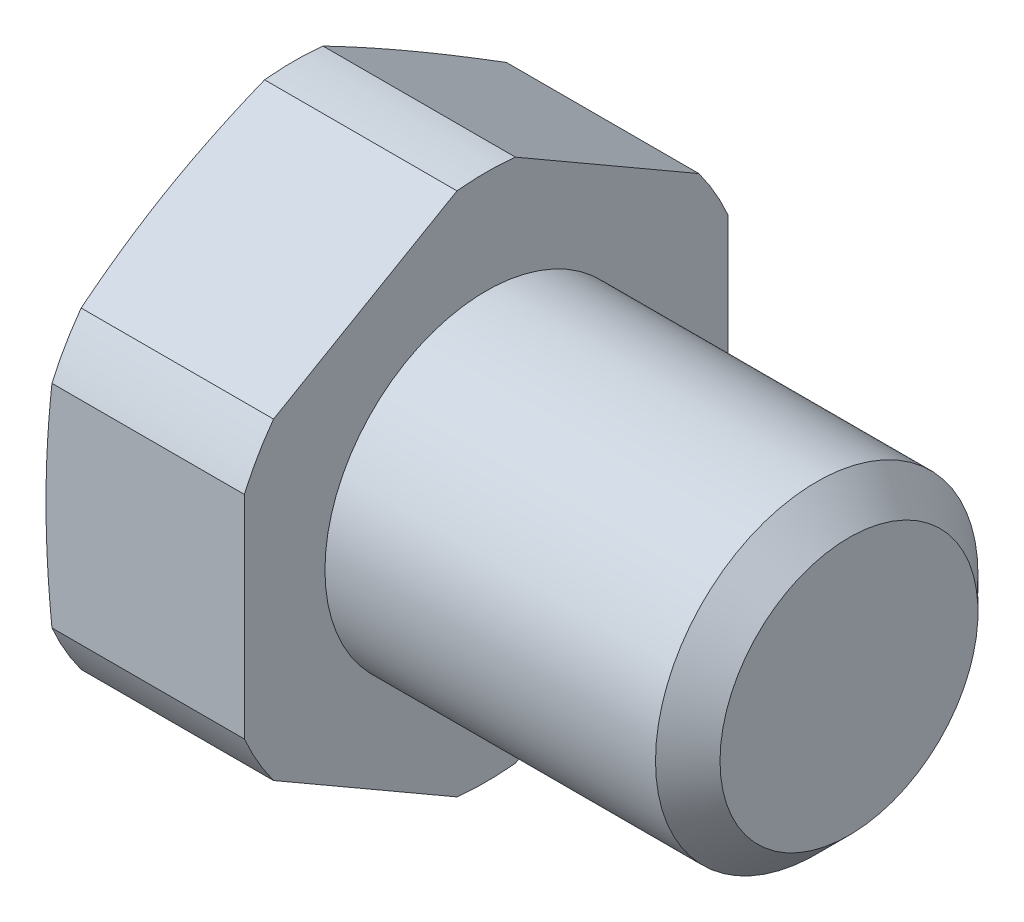
ISO-10303-21;
HEADER;
FILE_DESCRIPTION(('STEP AP214'),'2;1');
FILE_NAME('part.step','',(''),(''),'','','');
FILE_SCHEMA(('AUTOMOTIVE_DESIGN { 1 0 10303 214 1 1 1 1 }'));
ENDSEC;
DATA;
#1=APPLICATION_CONTEXT('core data for automotive mechanical design processes');
#2=APPLICATION_PROTOCOL_DEFINITION('international standard','automotive_design',2000,#1);
#3=PRODUCT_CONTEXT('',#1,'mechanical');
#4=PRODUCT('Part','Part','',(#3));
#5=PRODUCT_RELATED_PRODUCT_CATEGORY('part','',(#4));
#6=PRODUCT_DEFINITION_FORMATION('','',#4);
#7=PRODUCT_DEFINITION_CONTEXT('part definition',#1,'design');
#8=PRODUCT_DEFINITION('design','',#6,#7);
#9=PRODUCT_DEFINITION_SHAPE('','',#8);
#10=(LENGTH_UNIT() NAMED_UNIT(*) SI_UNIT(.MILLI.,.METRE.));
#11=(NAMED_UNIT(*) PLANE_ANGLE_UNIT() SI_UNIT($,.RADIAN.));
#12=(NAMED_UNIT(*) SI_UNIT($,.STERADIAN.) SOLID_ANGLE_UNIT());
#13=UNCERTAINTY_MEASURE_WITH_UNIT(LENGTH_MEASURE(1.E-05),#10,'distance_accuracy_value','');
#14=(GEOMETRIC_REPRESENTATION_CONTEXT(3) GLOBAL_UNCERTAINTY_ASSIGNED_CONTEXT((#13)) GLOBAL_UNIT_ASSIGNED_CONTEXT((#10,
#11,#12)) REPRESENTATION_CONTEXT('',''));
#15=CARTESIAN_POINT('',(0.,0.,0.));
#16=DIRECTION('',(0.,0.,1.));
#17=DIRECTION('',(1.,0.,0.));
#18=AXIS2_PLACEMENT_3D('',#15,#16,#17);
#19=CARTESIAN_POINT('',(-9.54448637286709,0.,0.));
#20=DIRECTION('',(1.,0.,0.));
#21=DIRECTION('',(0.,0.,-1.));
#22=AXIS2_PLACEMENT_3D('',#19,#20,#21);
#23=CONICAL_SURFACE('',#22,13.1,1.30899693899574);
#24=CARTESIAN_POINT('',(-10.,0.,0.));
#25=DIRECTION('',(-1.,0.,0.));
#26=DIRECTION('',(0.,0.,1.));
#27=AXIS2_PLACEMENT_3D('',#24,#25,#26);
#28=CIRCLE('',#27,11.4);
#29=CARTESIAN_POINT('',(-10.,0.,11.4));
#30=VERTEX_POINT('',#29);
#31=EDGE_CURVE('E136',#30,#30,#28,.T.);
#32=ORIENTED_EDGE('',*,*,#31,.F.);
#33=EDGE_LOOP('',(#32));
#34=FACE_BOUND('',#33,.T.);
#35=CARTESIAN_POINT('',(-9.54428637286709,7.76411361838279,-10.5521607372236));
#36=CARTESIAN_POINT('',(-9.59130577877762,7.98263521863659,-10.1736702230327));
#37=CARTESIAN_POINT('',(-9.63340710310515,8.20143630321216,-9.79469562779668));
#38=CARTESIAN_POINT('',(-9.70668581489536,8.63952643867748,-9.03590125487601));
#39=CARTESIAN_POINT('',(-9.73786154747224,8.85881555843141,-8.65608135791514));
#40=CARTESIAN_POINT('',(-9.78810717889402,9.29705355365927,-7.89703088437335));
#41=CARTESIAN_POINT('',(-9.80721488344556,9.51600132660838,-7.51780221742144));
#42=CARTESIAN_POINT('',(-9.83277608530208,9.95406769036877,-6.7590490183015));
#43=CARTESIAN_POINT('',(-9.83923048454133,10.1731862678911,-6.37952450915063));
#44=CARTESIAN_POINT('',(-9.83923048454133,10.6114234229357,-5.6204754908489));
#45=CARTESIAN_POINT('',(-9.83277608530207,10.830542000458,-5.24095098169803));
#46=CARTESIAN_POINT('',(-9.80721488344554,11.2686083642184,-4.48219778257809));
#47=CARTESIAN_POINT('',(-9.78810717889399,11.4875561371675,-4.10296911562618));
#48=CARTESIAN_POINT('',(-9.7378615474722,11.9257941323954,-3.34391864208439));
#49=CARTESIAN_POINT('',(-9.70668581489532,12.1450832521493,-2.96409874512353));
#50=CARTESIAN_POINT('',(-9.6334071031051,12.5831733876146,-2.20530437220285));
#51=CARTESIAN_POINT('',(-9.59130577877757,12.8019744721902,-1.82632977696681));
#52=CARTESIAN_POINT('',(-9.54428637286703,13.020496072444,-1.44783926277596));
#53=B_SPLINE_CURVE_WITH_KNOTS('',3,(#35,#36,#37,#38,#39,#40,#41,#42,#43,#44,#45,#46,#47,#48,#49,
#50,#51,#52),.UNSPECIFIED.,.F.,.F.,(4,2,2,2,2,2,2,2,4),(0.,1.31871238117365,2.63762441982744,
3.95238391533562,5.26704969068584,6.58171546603607,7.89647496154425,9.21538700019804,
10.5340993813717),.UNSPECIFIED.);
#54=CARTESIAN_POINT('',(-9.54448637286709,7.76504391432934,-10.5505494173781));
#55=VERTEX_POINT('',#54);
#56=CARTESIAN_POINT('',(-9.54448637286709,13.0195657764972,-1.44945058262192));
#57=VERTEX_POINT('',#56);
#58=EDGE_CURVE('E208',#55,#57,#53,.T.);
#59=ORIENTED_EDGE('',*,*,#58,.F.);
#60=CARTESIAN_POINT('',(-9.54448637286709,0.,0.));
#61=DIRECTION('',(-1.,0.,0.));
#62=DIRECTION('',(0.,0.,1.));
#63=AXIS2_PLACEMENT_3D('',#60,#61,#62);
#64=CIRCLE('',#63,13.1);
#65=CARTESIAN_POINT('',(-9.54448637286709,5.25452186216786,-12.));
#66=VERTEX_POINT('',#65);
#67=EDGE_CURVE('E291',#55,#66,#64,.T.);
#68=ORIENTED_EDGE('',*,*,#67,.T.);
#69=CARTESIAN_POINT('',(-7.19295796289398,-18.2909924344328,-12.));
#70=CARTESIAN_POINT('',(-7.3148003749587,-17.7469982484752,-12.));
#71=CARTESIAN_POINT('',(-7.43514648726094,-17.2026627913598,-12.));
#72=CARTESIAN_POINT('',(-7.67203849363134,-16.1131418101345,-12.));
#73=CARTESIAN_POINT('',(-7.7885842224288,-15.5679562501326,-12.));
#74=CARTESIAN_POINT('',(-8.01717027181336,-14.4760742685194,-12.));
#75=CARTESIAN_POINT('',(-8.12920601536953,-13.9293768852682,-12.));
#76=CARTESIAN_POINT('',(-8.34755693589704,-12.8348415359167,-12.));
#77=CARTESIAN_POINT('',(-8.45387216154037,-12.2870035795619,-12.));
#78=CARTESIAN_POINT('',(-8.65859640970622,-11.1943845169536,-12.));
#79=CARTESIAN_POINT('',(-8.7570619074514,-10.6496140449328,-12.));
#80=CARTESIAN_POINT('',(-8.94535866095745,-9.55857103473259,-12.));
#81=CARTESIAN_POINT('',(-9.03518988451791,-9.0122984909591,-12.));
#82=CARTESIAN_POINT('',(-9.20418374695558,-7.91817057841163,-12.));
#83=CARTESIAN_POINT('',(-9.28334789707893,-7.37031544510661,-12.));
#84=CARTESIAN_POINT('',(-9.42866949403048,-6.27286304206024,-12.));
#85=CARTESIAN_POINT('',(-9.494826930215,-5.72326577089364,-12.));
#86=CARTESIAN_POINT('',(-9.6122540230037,-4.61614250812887,-12.));
#87=CARTESIAN_POINT('',(-9.66334597348407,-4.05859738363546,-12.));
#88=CARTESIAN_POINT('',(-9.74711247173178,-2.94211342560942,-12.));
#89=CARTESIAN_POINT('',(-9.77978744184921,-2.38317462433277,-12.));
#90=CARTESIAN_POINT('',(-9.8248138629955,-1.26471341790144,-12.));
#91=CARTESIAN_POINT('',(-9.83717442597382,-0.70519138710796,-12.));
#92=CARTESIAN_POINT('',(-9.84081297334199,0.413922315015158,-12.));
#93=CARTESIAN_POINT('',(-9.83209096922124,0.97351398630668,-12.));
#94=CARTESIAN_POINT('',(-9.79405475762315,2.09402511795535,-12.));
#95=CARTESIAN_POINT('',(-9.76466559878528,2.65494198219382,-12.));
#96=CARTESIAN_POINT('',(-9.68696882411081,3.77545173452887,-12.));
#97=CARTESIAN_POINT('',(-9.63866079210955,4.33504459322843,-12.));
#98=CARTESIAN_POINT('',(-9.52555731405639,5.45290299353698,-12.));
#99=CARTESIAN_POINT('',(-9.46075117916776,6.01116743690909,-12.));
#100=CARTESIAN_POINT('',(-9.31733699991317,7.12590105610526,-12.));
#101=CARTESIAN_POINT('',(-9.23872891329198,7.6823702264277,-12.));
#102=CARTESIAN_POINT('',(-9.07584450117349,8.75644720293307,-12.));
#103=CARTESIAN_POINT('',(-8.99229805095426,9.27416682028566,-12.));
#104=CARTESIAN_POINT('',(-8.81712984665603,10.3082447927288,-12.));
#105=CARTESIAN_POINT('',(-8.72550787395778,10.8246031105765,-12.));
#106=CARTESIAN_POINT('',(-8.53566089294487,11.8561517991209,-12.));
#107=CARTESIAN_POINT('',(-8.43743522550391,12.3713420479096,-12.));
#108=CARTESIAN_POINT('',(-8.23559613103001,13.4006574238735,-12.));
#109=CARTESIAN_POINT('',(-8.13198275236719,13.9147825605681,-12.));
#110=CARTESIAN_POINT('',(-7.92031568551625,14.9422408608033,-12.));
#111=CARTESIAN_POINT('',(-7.81226096419997,15.4555738109251,-12.));
#112=CARTESIAN_POINT('',(-7.59250556252375,16.4814598527795,-12.));
#113=CARTESIAN_POINT('',(-7.48080486106903,16.9940129399819,-12.));
#114=CARTESIAN_POINT('',(-7.14121634875816,18.5306080543782,-12.));
#115=CARTESIAN_POINT('',(-6.90882770986833,19.553655015159,-12.));
#116=CARTESIAN_POINT('',(-6.43801048865108,21.5876992928676,-12.));
#117=CARTESIAN_POINT('',(-6.19966426332786,22.5987157977855,-12.));
#118=CARTESIAN_POINT('',(-5.71700677922169,24.619340765948,-12.));
#119=CARTESIAN_POINT('',(-5.47269541255234,25.6289492033764,-12.));
#120=CARTESIAN_POINT('',(-4.97995587716556,27.6458480272829,-12.));
#121=CARTESIAN_POINT('',(-4.73153311943045,28.6531397382875,-12.));
#122=CARTESIAN_POINT('',(-4.35638826441916,30.1634353752644,-12.));
#123=CARTESIAN_POINT('',(-4.23092355549836,30.6667522115923,-12.));
#124=CARTESIAN_POINT('',(-3.97925255433478,31.6731998943694,-12.));
#125=CARTESIAN_POINT('',(-3.85304626289051,32.1763307410182,-12.));
#126=CARTESIAN_POINT('',(-3.72651734695571,32.6793804342546,-12.));
#127=B_SPLINE_CURVE_WITH_KNOTS('',3,(#69,#70,#71,#72,#73,#74,#75,#76,#77,#78,#79,#80,#81,#82,
#83,#84,#85,#86,#87,#88,#89,#90,#91,#92,#93,#94,#95,#96,#97,#98,#99,#100,#101,#102,#103,#104,
#105,#106,#107,#108,#109,#110,#111,#112,#113,#114,#115,#116,#117,#118,#119,#120,#121,#122,#123,
#124,#125,#126),.UNSPECIFIED.,.F.,.F.,(4,2,2,2,2,2,2,2,2,2,2,2,2,2,2,2,2,2,2,2,2,2,2,2,2,2,2,2,
4),(0.,1.67242343795878,3.34491950937115,5.01907221717587,6.69321067850181,8.35394799901778,
10.0146915127963,11.6751994945867,13.335708835201,15.0150859542529,16.6944245591775,
18.3730096974211,20.0515939208845,21.7362972919581,23.421037724085,25.1068724607745,
26.7927123588034,28.3658892864153,29.9391088159116,31.5124856049936,33.0858482709583,
34.6595790210932,36.2333188780744,39.3805868978148,42.4967605354585,45.6129905744632,
48.725402385724,50.2815584550934,51.8377128491415),.UNSPECIFIED.);
#128=CARTESIAN_POINT('',(-9.54448637286709,-5.25452186216786,-12.));
#129=VERTEX_POINT('',#128);
#130=EDGE_CURVE('E187',#129,#66,#127,.T.);
#131=ORIENTED_EDGE('',*,*,#130,.F.);
#132=CARTESIAN_POINT('',(-9.54448637286709,-7.76504391432933,-10.5505494173781));
#133=VERTEX_POINT('',#132);
#134=EDGE_CURVE('E186',#129,#133,#64,.T.);
#135=ORIENTED_EDGE('',*,*,#134,.T.);
#136=CARTESIAN_POINT('',(-9.54428637286703,-13.020496072444,-1.44783926277596));
#137=CARTESIAN_POINT('',(-9.59130577877757,-12.8019744721902,-1.82632977696681));
#138=CARTESIAN_POINT('',(-9.6334071031051,-12.5831733876146,-2.20530437220286));
#139=CARTESIAN_POINT('',(-9.70668581489532,-12.1450832521493,-2.96409874512353));
#140=CARTESIAN_POINT('',(-9.7378615474722,-11.9257941323954,-3.34391864208439));
#141=CARTESIAN_POINT('',(-9.78810717889399,-11.4875561371675,-4.10296911562618));
#142=CARTESIAN_POINT('',(-9.80721488344554,-11.2686083642184,-4.48219778257809));
#143=CARTESIAN_POINT('',(-9.83277608530207,-10.830542000458,-5.24095098169803));
#144=CARTESIAN_POINT('',(-9.83923048454133,-10.6114234229357,-5.6204754908489));
#145=CARTESIAN_POINT('',(-9.83923048454133,-10.1731862678911,-6.37952450915063));
#146=CARTESIAN_POINT('',(-9.83277608530208,-9.95406769036877,-6.7590490183015));
#147=CARTESIAN_POINT('',(-9.80721488344556,-9.51600132660838,-7.51780221742144));
#148=CARTESIAN_POINT('',(-9.78810717889402,-9.29705355365928,-7.89703088437335));
#149=CARTESIAN_POINT('',(-9.73786154747224,-8.85881555843141,-8.65608135791514));
#150=CARTESIAN_POINT('',(-9.70668581489536,-8.63952643867748,-9.03590125487601));
#151=CARTESIAN_POINT('',(-9.63340710310515,-8.20143630321216,-9.79469562779668));
#152=CARTESIAN_POINT('',(-9.59130577877762,-7.98263521863659,-10.1736702230327));
#153=CARTESIAN_POINT('',(-9.54428637286709,-7.76411361838279,-10.5521607372236));
#154=B_SPLINE_CURVE_WITH_KNOTS('',3,(#136,#137,#138,#139,#140,#141,#142,#143,#144,#145,#146,
#147,#148,#149,#150,#151,#152,#153),.UNSPECIFIED.,.F.,.F.,(4,2,2,2,2,2,2,2,4),(0.,
1.31871238117365,2.63762441982744,3.95238391533562,5.26704969068584,6.58171546603606,
7.89647496154425,9.21538700019804,10.5340993813717),.UNSPECIFIED.);
#155=CARTESIAN_POINT('',(-9.54448637286709,-13.0195657764972,-1.44945058262192));
#156=VERTEX_POINT('',#155);
#157=EDGE_CURVE('E273',#156,#133,#154,.T.);
#158=ORIENTED_EDGE('',*,*,#157,.F.);
#159=CARTESIAN_POINT('',(-9.54448637286709,-13.0195657764972,1.44945058262192));
#160=VERTEX_POINT('',#159);
#161=EDGE_CURVE('E293',#156,#160,#64,.T.);
#162=ORIENTED_EDGE('',*,*,#161,.T.);
#163=CARTESIAN_POINT('',(-9.54428637286709,-7.76411361838279,10.5521607372236));
#164=CARTESIAN_POINT('',(-9.59130577877762,-7.9826352186366,10.1736702230327));
#165=CARTESIAN_POINT('',(-9.63340710310515,-8.20143630321216,9.79469562779668));
#166=CARTESIAN_POINT('',(-9.70668581489536,-8.63952643867748,9.035901254876));
#167=CARTESIAN_POINT('',(-9.73786154747224,-8.85881555843141,8.65608135791514));
#168=CARTESIAN_POINT('',(-9.78810717889402,-9.29705355365927,7.89703088437335));
#169=CARTESIAN_POINT('',(-9.80721488344556,-9.51600132660838,7.51780221742144));
#170=CARTESIAN_POINT('',(-9.83277608530208,-9.95406769036877,6.7590490183015));
#171=CARTESIAN_POINT('',(-9.83923048454133,-10.1731862678911,6.37952450915063));
#172=CARTESIAN_POINT('',(-9.83923048454133,-10.6114234229357,5.6204754908489));
#173=CARTESIAN_POINT('',(-9.83277608530207,-10.830542000458,5.24095098169803));
#174=CARTESIAN_POINT('',(-9.80721488344554,-11.2686083642184,4.48219778257809));
#175=CARTESIAN_POINT('',(-9.78810717889399,-11.4875561371675,4.10296911562618));
#176=CARTESIAN_POINT('',(-9.7378615474722,-11.9257941323954,3.34391864208439));
#177=CARTESIAN_POINT('',(-9.70668581489532,-12.1450832521493,2.96409874512353));
#178=CARTESIAN_POINT('',(-9.6334071031051,-12.5831733876146,2.20530437220285));
#179=CARTESIAN_POINT('',(-9.59130577877757,-12.8019744721902,1.82632977696681));
#180=CARTESIAN_POINT('',(-9.54428637286703,-13.020496072444,1.44783926277596));
#181=B_SPLINE_CURVE_WITH_KNOTS('',3,(#163,#164,#165,#166,#167,#168,#169,#170,#171,#172,#173,
#174,#175,#176,#177,#178,#179,#180),.UNSPECIFIED.,.F.,.F.,(4,2,2,2,2,2,2,2,4),(0.,
1.31871238117365,2.63762441982744,3.95238391533562,5.26704969068584,6.58171546603607,
7.89647496154425,9.21538700019804,10.5340993813717),.UNSPECIFIED.);
#182=CARTESIAN_POINT('',(-9.54448637286709,-7.76504391432934,10.5505494173781));
#183=VERTEX_POINT('',#182);
#184=EDGE_CURVE('E262',#183,#160,#181,.T.);
#185=ORIENTED_EDGE('',*,*,#184,.F.);
#186=CARTESIAN_POINT('',(-9.54448637286709,-5.25452186216786,12.));
#187=VERTEX_POINT('',#186);
#188=EDGE_CURVE('E154',#183,#187,#64,.T.);
#189=ORIENTED_EDGE('',*,*,#188,.T.);
#190=CARTESIAN_POINT('',(-7.19295796289398,-18.2909924344328,12.));
#191=CARTESIAN_POINT('',(-7.3148003749587,-17.7469982484752,12.));
#192=CARTESIAN_POINT('',(-7.43514648726094,-17.2026627913598,12.));
#193=CARTESIAN_POINT('',(-7.67203849363134,-16.1131418101345,12.));
#194=CARTESIAN_POINT('',(-7.7885842224288,-15.5679562501326,12.));
#195=CARTESIAN_POINT('',(-8.01717027181336,-14.4760742685194,12.));
#196=CARTESIAN_POINT('',(-8.12920601536953,-13.9293768852682,12.));
#197=CARTESIAN_POINT('',(-8.34755693589704,-12.8348415359167,12.));
#198=CARTESIAN_POINT('',(-8.45387216154037,-12.2870035795619,12.));
#199=CARTESIAN_POINT('',(-8.65859640970622,-11.1943845169536,12.));
#200=CARTESIAN_POINT('',(-8.7570619074514,-10.6496140449328,12.));
#201=CARTESIAN_POINT('',(-8.94535866095745,-9.55857103473259,12.));
#202=CARTESIAN_POINT('',(-9.03518988451791,-9.0122984909591,12.));
#203=CARTESIAN_POINT('',(-9.20418374695558,-7.91817057841163,12.));
#204=CARTESIAN_POINT('',(-9.28334789707893,-7.37031544510661,12.));
#205=CARTESIAN_POINT('',(-9.42866949403048,-6.27286304206024,12.));
#206=CARTESIAN_POINT('',(-9.494826930215,-5.72326577089364,12.));
#207=CARTESIAN_POINT('',(-9.6122540230037,-4.61614250812887,12.));
#208=CARTESIAN_POINT('',(-9.66334597348407,-4.05859738363546,12.));
#209=CARTESIAN_POINT('',(-9.74711247173178,-2.94211342560942,12.));
#210=CARTESIAN_POINT('',(-9.77978744184921,-2.38317462433277,12.));
#211=CARTESIAN_POINT('',(-9.8248138629955,-1.26471341790144,12.));
#212=CARTESIAN_POINT('',(-9.83717442597382,-0.705191387107961,12.));
#213=CARTESIAN_POINT('',(-9.84081297334199,0.413922315015158,12.));
#214=CARTESIAN_POINT('',(-9.83209096922124,0.973513986306682,12.));
#215=CARTESIAN_POINT('',(-9.79405475762315,2.09402511795535,12.));
#216=CARTESIAN_POINT('',(-9.76466559878528,2.65494198219382,12.));
#217=CARTESIAN_POINT('',(-9.68696882411081,3.77545173452887,12.));
#218=CARTESIAN_POINT('',(-9.63866079210955,4.33504459322843,12.));
#219=CARTESIAN_POINT('',(-9.52555731405639,5.45290299353699,12.));
#220=CARTESIAN_POINT('',(-9.46075117916776,6.0111674369091,12.));
#221=CARTESIAN_POINT('',(-9.31733699991317,7.12590105610526,12.));
#222=CARTESIAN_POINT('',(-9.23872891329198,7.6823702264277,12.));
#223=CARTESIAN_POINT('',(-9.07584450117349,8.75644720293308,12.));
#224=CARTESIAN_POINT('',(-8.99229805095425,9.27416682028567,12.));
#225=CARTESIAN_POINT('',(-8.81712984665603,10.3082447927288,12.));
#226=CARTESIAN_POINT('',(-8.72550787395778,10.8246031105765,12.));
#227=CARTESIAN_POINT('',(-8.53566089294487,11.8561517991208,12.));
#228=CARTESIAN_POINT('',(-8.43743522550391,12.3713420479096,12.));
#229=CARTESIAN_POINT('',(-8.23559613103002,13.4006574238735,12.));
#230=CARTESIAN_POINT('',(-8.13198275236719,13.9147825605681,12.));
#231=CARTESIAN_POINT('',(-7.92031568551625,14.9422408608033,12.));
#232=CARTESIAN_POINT('',(-7.81226096419997,15.4555738109251,12.));
#233=CARTESIAN_POINT('',(-7.59250556252375,16.4814598527795,12.));
#234=CARTESIAN_POINT('',(-7.48080486106903,16.9940129399819,12.));
#235=CARTESIAN_POINT('',(-7.14121634875816,18.5306080543782,12.));
#236=CARTESIAN_POINT('',(-6.90882770986833,19.553655015159,12.));
#237=CARTESIAN_POINT('',(-6.43801048865108,21.5876992928676,12.));
#238=CARTESIAN_POINT('',(-6.19966426332786,22.5987157977855,12.));
#239=CARTESIAN_POINT('',(-5.71700677922169,24.619340765948,12.));
#240=CARTESIAN_POINT('',(-5.47269541255234,25.6289492033764,12.));
#241=CARTESIAN_POINT('',(-4.97995587716556,27.6458480272829,12.));
#242=CARTESIAN_POINT('',(-4.73153311943045,28.6531397382875,12.));
#243=CARTESIAN_POINT('',(-4.35638826441916,30.1634353752644,12.));
#244=CARTESIAN_POINT('',(-4.23092355549836,30.6667522115923,12.));
#245=CARTESIAN_POINT('',(-3.97925255433478,31.6731998943694,12.));
#246=CARTESIAN_POINT('',(-3.85304626289051,32.1763307410182,12.));
#247=CARTESIAN_POINT('',(-3.72651734695571,32.6793804342546,12.));
#248=B_SPLINE_CURVE_WITH_KNOTS('',3,(#190,#191,#192,#193,#194,#195,#196,#197,#198,#199,#200,
#201,#202,#203,#204,#205,#206,#207,#208,#209,#210,#211,#212,#213,#214,#215,#216,#217,#218,#219,
#220,#221,#222,#223,#224,#225,#226,#227,#228,#229,#230,#231,#232,#233,#234,#235,#236,#237,#238,
#239,#240,#241,#242,#243,#244,#245,#246,#247),.UNSPECIFIED.,.F.,.F.,(4,2,2,2,2,2,2,2,2,2,2,2,2,
2,2,2,2,2,2,2,2,2,2,2,2,2,2,2,4),(0.,1.67242343795878,3.34491950937115,5.01907221717587,
6.69321067850181,8.35394799901778,10.0146915127963,11.6751994945867,13.335708835201,
15.0150859542529,16.6944245591775,18.3730096974211,20.0515939208845,21.7362972919581,
23.421037724085,25.1068724607745,26.7927123588034,28.3658892864153,29.9391088159116,
31.5124856049936,33.0858482709583,34.6595790210932,36.2333188780744,39.3805868978148,
42.4967605354585,45.6129905744632,48.725402385724,50.2815584550934,51.8377128491415),.UNSPECIFIED.);
#249=CARTESIAN_POINT('',(-9.54448637286709,5.25452186216786,12.));
#250=VERTEX_POINT('',#249);
#251=EDGE_CURVE('E245',#250,#187,#248,.F.);
#252=ORIENTED_EDGE('',*,*,#251,.F.);
#253=CARTESIAN_POINT('',(-9.54448637286709,7.76504391432934,10.5505494173781));
#254=VERTEX_POINT('',#253);
#255=EDGE_CURVE('E162',#250,#254,#64,.T.);
#256=ORIENTED_EDGE('',*,*,#255,.T.);
#257=CARTESIAN_POINT('',(-9.54428637286703,13.020496072444,1.44783926277596));
#258=CARTESIAN_POINT('',(-9.59130577877757,12.8019744721902,1.82632977696681));
#259=CARTESIAN_POINT('',(-9.6334071031051,12.5831733876146,2.20530437220285));
#260=CARTESIAN_POINT('',(-9.70668581489532,12.1450832521493,2.96409874512353));
#261=CARTESIAN_POINT('',(-9.7378615474722,11.9257941323954,3.34391864208439));
#262=CARTESIAN_POINT('',(-9.78810717889399,11.4875561371675,4.10296911562618));
#263=CARTESIAN_POINT('',(-9.80721488344554,11.2686083642184,4.48219778257809));
#264=CARTESIAN_POINT('',(-9.83277608530207,10.830542000458,5.24095098169803));
#265=CARTESIAN_POINT('',(-9.83923048454133,10.6114234229357,5.6204754908489));
#266=CARTESIAN_POINT('',(-9.83923048454133,10.1731862678911,6.37952450915063));
#267=CARTESIAN_POINT('',(-9.83277608530208,9.95406769036877,6.7590490183015));
#268=CARTESIAN_POINT('',(-9.80721488344556,9.51600132660838,7.51780221742144));
#269=CARTESIAN_POINT('',(-9.78810717889402,9.29705355365928,7.89703088437335));
#270=CARTESIAN_POINT('',(-9.73786154747224,8.85881555843141,8.65608135791514));
#271=CARTESIAN_POINT('',(-9.70668581489536,8.63952643867748,9.035901254876));
#272=CARTESIAN_POINT('',(-9.63340710310515,8.20143630321216,9.79469562779668));
#273=CARTESIAN_POINT('',(-9.59130577877762,7.9826352186366,10.1736702230327));
#274=CARTESIAN_POINT('',(-9.54428637286709,7.76411361838279,10.5521607372236));
#275=B_SPLINE_CURVE_WITH_KNOTS('',3,(#257,#258,#259,#260,#261,#262,#263,#264,#265,#266,#267,
#268,#269,#270,#271,#272,#273,#274),.UNSPECIFIED.,.F.,.F.,(4,2,2,2,2,2,2,2,4),(0.,
1.31871238117365,2.63762441982744,3.95238391533562,5.26704969068584,6.58171546603607,
7.89647496154425,9.21538700019804,10.5340993813717),.UNSPECIFIED.);
#276=CARTESIAN_POINT('',(-9.54448637286709,13.0195657764972,1.44945058262192));
#277=VERTEX_POINT('',#276);
#278=EDGE_CURVE('E146',#277,#254,#275,.T.);
#279=ORIENTED_EDGE('',*,*,#278,.F.);
#280=EDGE_CURVE('E145',#277,#57,#64,.T.);
#281=ORIENTED_EDGE('',*,*,#280,.T.);
#282=EDGE_LOOP('',(#59,#68,#131,#135,#158,#162,#185,#189,#252,#256,#279,#281));
#283=FACE_BOUND('',#282,.T.);
#284=ADVANCED_FACE('F37',(#34,#283),#23,.T.);
#285=CARTESIAN_POINT('',(-1000.,0.,0.));
#286=DIRECTION('',(-1.,0.,0.));
#287=DIRECTION('',(0.,0.,1.));
#288=AXIS2_PLACEMENT_3D('',#285,#286,#287);
#289=CYLINDRICAL_SURFACE('',#288,13.1);
#290=DIRECTION('',(-1.,0.,0.));
#291=VECTOR('',#290,1.);
#292=CARTESIAN_POINT('',(-1000.,7.76504391432934,-10.5505494173781));
#293=LINE('',#292,#291);
#294=CARTESIAN_POINT('',(0.,7.76504391432933,-10.5505494173781));
#295=VERTEX_POINT('',#294);
#296=EDGE_CURVE('E217',#295,#55,#293,.T.);
#297=ORIENTED_EDGE('',*,*,#296,.F.);
#298=CARTESIAN_POINT('',(0.,0.,0.));
#299=DIRECTION('',(-1.,0.,0.));
#300=DIRECTION('',(0.,0.,1.));
#301=AXIS2_PLACEMENT_3D('',#298,#299,#300);
#302=CIRCLE('',#301,13.1);
#303=CARTESIAN_POINT('',(0.,5.25452186216786,-12.));
#304=VERTEX_POINT('',#303);
#305=EDGE_CURVE('E152',#295,#304,#302,.T.);
#306=ORIENTED_EDGE('',*,*,#305,.T.);
#307=DIRECTION('',(-1.,0.,0.));
#308=VECTOR('',#307,1.);
#309=CARTESIAN_POINT('',(-1000.,5.25452186216786,-12.));
#310=LINE('',#309,#308);
#311=EDGE_CURVE('E178',#66,#304,#310,.F.);
#312=ORIENTED_EDGE('',*,*,#311,.F.);
#313=ORIENTED_EDGE('',*,*,#67,.F.);
#314=EDGE_LOOP('',(#297,#306,#312,#313));
#315=FACE_BOUND('',#314,.T.);
#316=ADVANCED_FACE('F292',(#315),#289,.T.);
#317=DIRECTION('',(-1.,0.,0.));
#318=VECTOR('',#317,1.);
#319=CARTESIAN_POINT('',(-1000.,13.0195657764972,-1.44945058262192));
#320=LINE('',#319,#318);
#321=CARTESIAN_POINT('',(0.,13.0195657764972,-1.44945058262192));
#322=VERTEX_POINT('',#321);
#323=EDGE_CURVE('E284',#57,#322,#320,.F.);
#324=ORIENTED_EDGE('',*,*,#323,.F.);
#325=ORIENTED_EDGE('',*,*,#280,.F.);
#326=DIRECTION('',(-1.,0.,0.));
#327=VECTOR('',#326,1.);
#328=CARTESIAN_POINT('',(-1000.,13.0195657764972,1.44945058262192));
#329=LINE('',#328,#327);
#330=CARTESIAN_POINT('',(0.,13.0195657764972,1.44945058262191));
#331=VERTEX_POINT('',#330);
#332=EDGE_CURVE('E127',#331,#277,#329,.T.);
#333=ORIENTED_EDGE('',*,*,#332,.F.);
#334=EDGE_CURVE('E143',#331,#322,#302,.T.);
#335=ORIENTED_EDGE('',*,*,#334,.T.);
#336=EDGE_LOOP('',(#324,#325,#333,#335));
#337=FACE_BOUND('',#336,.T.);
#338=ADVANCED_FACE('F142',(#337),#289,.T.);
#339=DIRECTION('',(-1.,0.,0.));
#340=VECTOR('',#339,1.);
#341=CARTESIAN_POINT('',(-1000.,-5.25452186216786,-12.));
#342=LINE('',#341,#340);
#343=CARTESIAN_POINT('',(0.,-5.25452186216786,-12.));
#344=VERTEX_POINT('',#343);
#345=EDGE_CURVE('E175',#344,#129,#342,.T.);
#346=ORIENTED_EDGE('',*,*,#345,.F.);
#347=CARTESIAN_POINT('',(0.,-7.76504391432934,-10.5505494173781));
#348=VERTEX_POINT('',#347);
#349=EDGE_CURVE('E157',#344,#348,#302,.T.);
#350=ORIENTED_EDGE('',*,*,#349,.T.);
#351=DIRECTION('',(-1.,0.,0.));
#352=VECTOR('',#351,1.);
#353=CARTESIAN_POINT('',(-1000.,-7.76504391432933,-10.5505494173781));
#354=LINE('',#353,#352);
#355=EDGE_CURVE('E268',#133,#348,#354,.F.);
#356=ORIENTED_EDGE('',*,*,#355,.F.);
#357=ORIENTED_EDGE('',*,*,#134,.F.);
#358=EDGE_LOOP('',(#346,#350,#356,#357));
#359=FACE_BOUND('',#358,.T.);
#360=ADVANCED_FACE('F183',(#359),#289,.T.);
#361=DIRECTION('',(-1.,0.,0.));
#362=VECTOR('',#361,1.);
#363=CARTESIAN_POINT('',(-1000.,-13.0195657764972,-1.44945058262192));
#364=LINE('',#363,#362);
#365=CARTESIAN_POINT('',(0.,-13.0195657764972,-1.44945058262193));
#366=VERTEX_POINT('',#365);
#367=EDGE_CURVE('E271',#366,#156,#364,.T.);
#368=ORIENTED_EDGE('',*,*,#367,.F.);
#369=CARTESIAN_POINT('',(0.,-13.0195657764972,1.44945058262192));
#370=VERTEX_POINT('',#369);
#371=EDGE_CURVE('E191',#366,#370,#302,.T.);
#372=ORIENTED_EDGE('',*,*,#371,.T.);
#373=DIRECTION('',(-1.,0.,0.));
#374=VECTOR('',#373,1.);
#375=CARTESIAN_POINT('',(-1000.,-13.0195657764972,1.44945058262192));
#376=LINE('',#375,#374);
#377=EDGE_CURVE('E60',#160,#370,#376,.F.);
#378=ORIENTED_EDGE('',*,*,#377,.F.);
#379=ORIENTED_EDGE('',*,*,#161,.F.);
#380=EDGE_LOOP('',(#368,#372,#378,#379));
#381=FACE_BOUND('',#380,.T.);
#382=ADVANCED_FACE('F312',(#381),#289,.T.);
#383=DIRECTION('',(-1.,0.,0.));
#384=VECTOR('',#383,1.);
#385=CARTESIAN_POINT('',(-1000.,-7.76504391432934,10.5505494173781));
#386=LINE('',#385,#384);
#387=CARTESIAN_POINT('',(0.,-7.76504391432934,10.5505494173781));
#388=VERTEX_POINT('',#387);
#389=EDGE_CURVE('E269',#388,#183,#386,.T.);
#390=ORIENTED_EDGE('',*,*,#389,.F.);
#391=CARTESIAN_POINT('',(0.,-5.25452186216786,12.));
#392=VERTEX_POINT('',#391);
#393=EDGE_CURVE('E155',#388,#392,#302,.T.);
#394=ORIENTED_EDGE('',*,*,#393,.T.);
#395=DIRECTION('',(-1.,0.,0.));
#396=VECTOR('',#395,1.);
#397=CARTESIAN_POINT('',(-1000.,-5.25452186216786,12.));
#398=LINE('',#397,#396);
#399=EDGE_CURVE('E52',#187,#392,#398,.F.);
#400=ORIENTED_EDGE('',*,*,#399,.F.);
#401=ORIENTED_EDGE('',*,*,#188,.F.);
#402=EDGE_LOOP('',(#390,#394,#400,#401));
#403=FACE_BOUND('',#402,.T.);
#404=ADVANCED_FACE('F302',(#403),#289,.T.);
#405=DIRECTION('',(-1.,0.,0.));
#406=VECTOR('',#405,1.);
#407=CARTESIAN_POINT('',(-1000.,5.25452186216786,12.));
#408=LINE('',#407,#406);
#409=CARTESIAN_POINT('',(0.,5.25452186216786,12.));
#410=VERTEX_POINT('',#409);
#411=EDGE_CURVE('E243',#410,#250,#408,.T.);
#412=ORIENTED_EDGE('',*,*,#411,.F.);
#413=CARTESIAN_POINT('',(0.,7.76504391432934,10.5505494173781));
#414=VERTEX_POINT('',#413);
#415=EDGE_CURVE('E151',#410,#414,#302,.T.);
#416=ORIENTED_EDGE('',*,*,#415,.T.);
#417=DIRECTION('',(-1.,0.,0.));
#418=VECTOR('',#417,1.);
#419=CARTESIAN_POINT('',(-1000.,7.76504391432934,10.5505494173781));
#420=LINE('',#419,#418);
#421=EDGE_CURVE('E130',#254,#414,#420,.F.);
#422=ORIENTED_EDGE('',*,*,#421,.F.);
#423=ORIENTED_EDGE('',*,*,#255,.F.);
#424=EDGE_LOOP('',(#412,#416,#422,#423));
#425=FACE_BOUND('',#424,.T.);
#426=ADVANCED_FACE('F305',(#425),#289,.T.);
#427=CARTESIAN_POINT('',(0.,13.1,0.));
#428=DIRECTION('',(-1.,0.,0.));
#429=DIRECTION('',(0.,0.,1.));
#430=AXIS2_PLACEMENT_3D('',#427,#428,#429);
#431=PLANE('',#430);
#432=CARTESIAN_POINT('',(0.,0.,0.));
#433=DIRECTION('',(-1.,0.,0.));
#434=DIRECTION('',(0.,0.,1.));
#435=AXIS2_PLACEMENT_3D('',#432,#433,#434);
#436=CIRCLE('',#435,8.);
#437=CARTESIAN_POINT('',(0.,0.,8.));
#438=VERTEX_POINT('',#437);
#439=EDGE_CURVE('E160',#438,#438,#436,.T.);
#440=ORIENTED_EDGE('',*,*,#439,.T.);
#441=EDGE_LOOP('',(#440));
#442=FACE_BOUND('',#441,.T.);
#443=DIRECTION('',(0.,-0.5,-0.866025403784439));
#444=VECTOR('',#443,1.);
#445=CARTESIAN_POINT('',(0.,13.6673048454133,-0.327533605211926));
#446=LINE('',#445,#444);
#447=EDGE_CURVE('E12',#322,#295,#446,.T.);
#448=ORIENTED_EDGE('',*,*,#447,.F.);
#449=ORIENTED_EDGE('',*,*,#334,.F.);
#450=DIRECTION('',(0.,0.5,-0.866025403784439));
#451=VECTOR('',#450,1.);
#452=CARTESIAN_POINT('',(0.,13.6673048454133,0.327533605211927));
#453=LINE('',#452,#451);
#454=EDGE_CURVE('E124',#414,#331,#453,.T.);
#455=ORIENTED_EDGE('',*,*,#454,.F.);
#456=ORIENTED_EDGE('',*,*,#415,.F.);
#457=DIRECTION('',(0.,1.,0.));
#458=VECTOR('',#457,1.);
#459=CARTESIAN_POINT('',(0.,13.1,12.));
#460=LINE('',#459,#458);
#461=EDGE_CURVE('E135',#392,#410,#460,.T.);
#462=ORIENTED_EDGE('',*,*,#461,.F.);
#463=ORIENTED_EDGE('',*,*,#393,.F.);
#464=DIRECTION('',(0.,0.5,0.866025403784439));
#465=VECTOR('',#464,1.);
#466=CARTESIAN_POINT('',(0.,-7.11730484541327,11.6724663947881));
#467=LINE('',#466,#465);
#468=EDGE_CURVE('E168',#370,#388,#467,.T.);
#469=ORIENTED_EDGE('',*,*,#468,.F.);
#470=ORIENTED_EDGE('',*,*,#371,.F.);
#471=DIRECTION('',(0.,-0.5,0.866025403784439));
#472=VECTOR('',#471,1.);
#473=CARTESIAN_POINT('',(0.,-7.11730484541327,-11.6724663947881));
#474=LINE('',#473,#472);
#475=EDGE_CURVE('E170',#348,#366,#474,.T.);
#476=ORIENTED_EDGE('',*,*,#475,.F.);
#477=ORIENTED_EDGE('',*,*,#349,.F.);
#478=DIRECTION('',(0.,-1.,0.));
#479=VECTOR('',#478,1.);
#480=CARTESIAN_POINT('',(0.,13.1,-12.));
#481=LINE('',#480,#479);
#482=EDGE_CURVE('E45',#304,#344,#481,.T.);
#483=ORIENTED_EDGE('',*,*,#482,.F.);
#484=ORIENTED_EDGE('',*,*,#305,.F.);
#485=EDGE_LOOP('',(#448,#449,#455,#456,#462,#463,#469,#470,#476,#477,#483,#484));
#486=FACE_BOUND('',#485,.T.);
#487=ADVANCED_FACE('F149',(#442,#486),#431,.F.);
#488=CARTESIAN_POINT('',(-10.,0.,0.));
#489=DIRECTION('',(1.,0.,0.));
#490=DIRECTION('',(0.,0.,-1.));
#491=AXIS2_PLACEMENT_3D('',#488,#489,#490);
#492=PLANE('',#491);
#493=ORIENTED_EDGE('',*,*,#31,.T.);
#494=EDGE_LOOP('',(#493));
#495=FACE_BOUND('',#494,.T.);
#496=ADVANCED_FACE('F39',(#495),#492,.F.);
#497=CARTESIAN_POINT('',(-1000.,0.,0.));
#498=DIRECTION('',(-1.,0.,0.));
#499=DIRECTION('',(0.,0.,1.));
#500=AXIS2_PLACEMENT_3D('',#497,#498,#499);
#501=CYLINDRICAL_SURFACE('',#500,8.);
#502=ORIENTED_EDGE('',*,*,#439,.F.);
#503=EDGE_LOOP('',(#502));
#504=FACE_BOUND('',#503,.T.);
#505=CARTESIAN_POINT('',(16.4,0.,0.));
#506=DIRECTION('',(-1.,0.,0.));
#507=DIRECTION('',(0.,0.,1.));
#508=AXIS2_PLACEMENT_3D('',#505,#506,#507);
#509=CIRCLE('',#508,8.);
#510=CARTESIAN_POINT('',(16.4,0.,8.));
#511=VERTEX_POINT('',#510);
#512=EDGE_CURVE('E200',#511,#511,#509,.T.);
#513=ORIENTED_EDGE('',*,*,#512,.T.);
#514=EDGE_LOOP('',(#513));
#515=FACE_BOUND('',#514,.T.);
#516=ADVANCED_FACE('F321',(#504,#515),#501,.T.);
#517=CARTESIAN_POINT('',(18.,0.,0.));
#518=DIRECTION('',(-1.,0.,0.));
#519=DIRECTION('',(0.,0.,1.));
#520=AXIS2_PLACEMENT_3D('',#517,#518,#519);
#521=CONICAL_SURFACE('',#520,6.4,0.785398163397433);
#522=ORIENTED_EDGE('',*,*,#512,.F.);
#523=EDGE_LOOP('',(#522));
#524=FACE_BOUND('',#523,.T.);
#525=CARTESIAN_POINT('',(18.,0.,0.));
#526=DIRECTION('',(-1.,0.,0.));
#527=DIRECTION('',(0.,0.,1.));
#528=AXIS2_PLACEMENT_3D('',#525,#526,#527);
#529=CIRCLE('',#528,6.4);
#530=CARTESIAN_POINT('',(18.,0.,6.4));
#531=VERTEX_POINT('',#530);
#532=EDGE_CURVE('E204',#531,#531,#529,.T.);
#533=ORIENTED_EDGE('',*,*,#532,.T.);
#534=EDGE_LOOP('',(#533));
#535=FACE_BOUND('',#534,.T.);
#536=ADVANCED_FACE('F325',(#524,#535),#521,.T.);
#537=CARTESIAN_POINT('',(18.,6.4,0.));
#538=DIRECTION('',(-1.,0.,0.));
#539=DIRECTION('',(0.,0.,1.));
#540=AXIS2_PLACEMENT_3D('',#537,#538,#539);
#541=PLANE('',#540);
#542=ORIENTED_EDGE('',*,*,#532,.F.);
#543=EDGE_LOOP('',(#542));
#544=FACE_BOUND('',#543,.T.);
#545=ADVANCED_FACE('F233',(#544),#541,.F.);
#546=CARTESIAN_POINT('',(56.5184922342503,6.92820323027551,12.));
#547=DIRECTION('',(0.,0.866025403784439,0.5));
#548=DIRECTION('',(0.,-0.5,0.866025403784439));
#549=AXIS2_PLACEMENT_3D('',#546,#547,#548);
#550=PLANE('',#549);
#551=ORIENTED_EDGE('',*,*,#278,.T.);
#552=ORIENTED_EDGE('',*,*,#421,.T.);
#553=ORIENTED_EDGE('',*,*,#454,.T.);
#554=ORIENTED_EDGE('',*,*,#332,.T.);
#555=EDGE_LOOP('',(#551,#552,#553,#554));
#556=FACE_BOUND('',#555,.T.);
#557=ADVANCED_FACE('F126',(#556),#550,.T.);
#558=CARTESIAN_POINT('',(56.5184922342503,-6.92820323027551,12.));
#559=DIRECTION('',(0.,0.,1.));
#560=DIRECTION('',(1.,0.,0.));
#561=AXIS2_PLACEMENT_3D('',#558,#559,#560);
#562=PLANE('',#561);
#563=ORIENTED_EDGE('',*,*,#251,.T.);
#564=ORIENTED_EDGE('',*,*,#399,.T.);
#565=ORIENTED_EDGE('',*,*,#461,.T.);
#566=ORIENTED_EDGE('',*,*,#411,.T.);
#567=EDGE_LOOP('',(#563,#564,#565,#566));
#568=FACE_BOUND('',#567,.T.);
#569=ADVANCED_FACE('F232',(#568),#562,.T.);
#570=CARTESIAN_POINT('',(56.5184922342503,-13.856406460551,0.));
#571=DIRECTION('',(0.,-0.866025403784439,0.5));
#572=DIRECTION('',(0.,-0.5,-0.866025403784439));
#573=AXIS2_PLACEMENT_3D('',#570,#571,#572);
#574=PLANE('',#573);
#575=ORIENTED_EDGE('',*,*,#184,.T.);
#576=ORIENTED_EDGE('',*,*,#377,.T.);
#577=ORIENTED_EDGE('',*,*,#468,.T.);
#578=ORIENTED_EDGE('',*,*,#389,.T.);
#579=EDGE_LOOP('',(#575,#576,#577,#578));
#580=FACE_BOUND('',#579,.T.);
#581=ADVANCED_FACE('F256',(#580),#574,.T.);
#582=CARTESIAN_POINT('',(56.5184922342503,-6.92820323027551,-12.));
#583=DIRECTION('',(0.,-0.866025403784439,-0.5));
#584=DIRECTION('',(0.,0.5,-0.866025403784439));
#585=AXIS2_PLACEMENT_3D('',#582,#583,#584);
#586=PLANE('',#585);
#587=ORIENTED_EDGE('',*,*,#157,.T.);
#588=ORIENTED_EDGE('',*,*,#355,.T.);
#589=ORIENTED_EDGE('',*,*,#475,.T.);
#590=ORIENTED_EDGE('',*,*,#367,.T.);
#591=EDGE_LOOP('',(#587,#588,#589,#590));
#592=FACE_BOUND('',#591,.T.);
#593=ADVANCED_FACE('F259',(#592),#586,.T.);
#594=CARTESIAN_POINT('',(56.5184922342503,6.92820323027551,-12.));
#595=DIRECTION('',(0.,0.,-1.));
#596=DIRECTION('',(-1.,0.,0.));
#597=AXIS2_PLACEMENT_3D('',#594,#595,#596);
#598=PLANE('',#597);
#599=ORIENTED_EDGE('',*,*,#130,.T.);
#600=ORIENTED_EDGE('',*,*,#311,.T.);
#601=ORIENTED_EDGE('',*,*,#482,.T.);
#602=ORIENTED_EDGE('',*,*,#345,.T.);
#603=EDGE_LOOP('',(#599,#600,#601,#602));
#604=FACE_BOUND('',#603,.T.);
#605=ADVANCED_FACE('F174',(#604),#598,.T.);
#606=CARTESIAN_POINT('',(56.5184922342503,13.856406460551,0.));
#607=DIRECTION('',(0.,0.866025403784439,-0.5));
#608=DIRECTION('',(0.,0.5,0.866025403784439));
#609=AXIS2_PLACEMENT_3D('',#606,#607,#608);
#610=PLANE('',#609);
#611=ORIENTED_EDGE('',*,*,#58,.T.);
#612=ORIENTED_EDGE('',*,*,#323,.T.);
#613=ORIENTED_EDGE('',*,*,#447,.T.);
#614=ORIENTED_EDGE('',*,*,#296,.T.);
#615=EDGE_LOOP('',(#611,#612,#613,#614));
#616=FACE_BOUND('',#615,.T.);
#617=ADVANCED_FACE('F221',(#616),#610,.T.);
#618=CLOSED_SHELL('',(#284,#316,#338,#360,#382,#404,#426,#487,#496,#516,#536,#545,#557,#569,
#581,#593,#605,#617));
#619=MANIFOLD_SOLID_BREP('B2',#618);
#620=ADVANCED_BREP_SHAPE_REPRESENTATION('',(#18,#619),#14);
#621=SHAPE_DEFINITION_REPRESENTATION(#9,#620);
ENDSEC;
END-ISO-10303-21;
